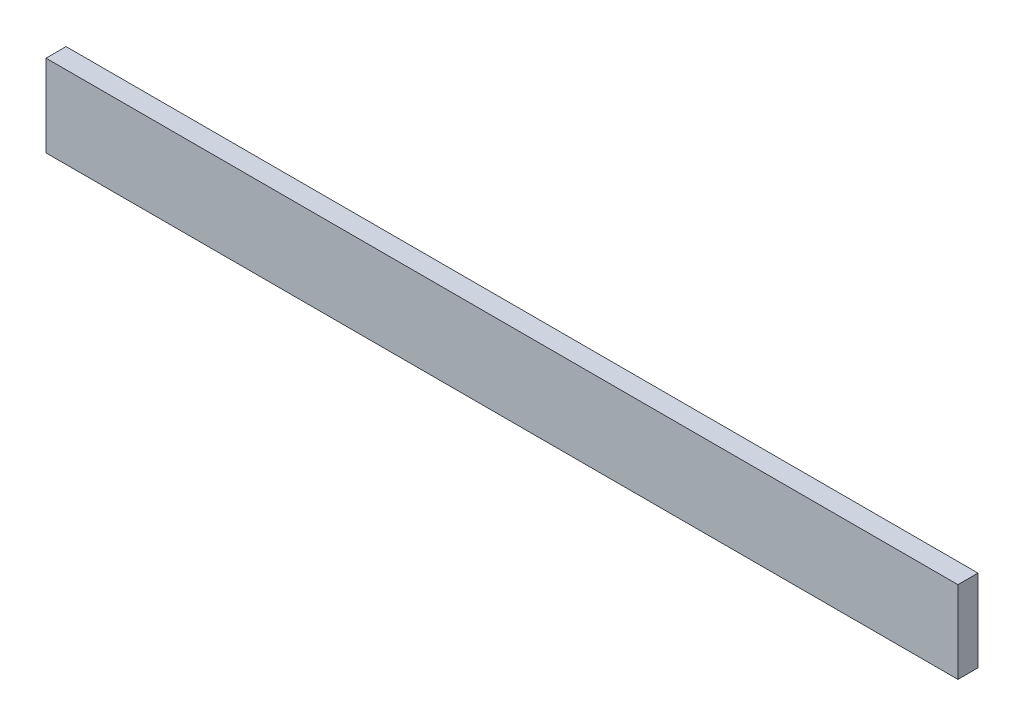
ISO-10303-21;
HEADER;
FILE_DESCRIPTION(('STEP AP214'),'2;1');
FILE_NAME('part.step','',(''),(''),'','','');
FILE_SCHEMA(('AUTOMOTIVE_DESIGN { 1 0 10303 214 1 1 1 1 }'));
ENDSEC;
DATA;
#1=APPLICATION_CONTEXT('core data for automotive mechanical design processes');
#2=APPLICATION_PROTOCOL_DEFINITION('international standard','automotive_design',2000,#1);
#3=PRODUCT_CONTEXT('',#1,'mechanical');
#4=PRODUCT('Part','Part','',(#3));
#5=PRODUCT_RELATED_PRODUCT_CATEGORY('part','',(#4));
#6=PRODUCT_DEFINITION_FORMATION('','',#4);
#7=PRODUCT_DEFINITION_CONTEXT('part definition',#1,'design');
#8=PRODUCT_DEFINITION('design','',#6,#7);
#9=PRODUCT_DEFINITION_SHAPE('','',#8);
#10=(LENGTH_UNIT() NAMED_UNIT(*) SI_UNIT(.MILLI.,.METRE.));
#11=(NAMED_UNIT(*) PLANE_ANGLE_UNIT() SI_UNIT($,.RADIAN.));
#12=(NAMED_UNIT(*) SI_UNIT($,.STERADIAN.) SOLID_ANGLE_UNIT());
#13=UNCERTAINTY_MEASURE_WITH_UNIT(LENGTH_MEASURE(1.E-05),#10,'distance_accuracy_value','');
#14=(GEOMETRIC_REPRESENTATION_CONTEXT(3) GLOBAL_UNCERTAINTY_ASSIGNED_CONTEXT((#13)) GLOBAL_UNIT_ASSIGNED_CONTEXT((#10,
#11,#12)) REPRESENTATION_CONTEXT('',''));
#15=CARTESIAN_POINT('',(0.,0.,0.));
#16=DIRECTION('',(0.,0.,1.));
#17=DIRECTION('',(1.,0.,0.));
#18=AXIS2_PLACEMENT_3D('',#15,#16,#17);
#19=CARTESIAN_POINT('',(0.,0.,22.));
#20=DIRECTION('',(1.,0.,0.));
#21=DIRECTION('',(0.,0.,-1.));
#22=AXIS2_PLACEMENT_3D('',#19,#20,#21);
#23=PLANE('',#22);
#24=DIRECTION('',(0.,-1.,0.));
#25=VECTOR('',#24,1.);
#26=CARTESIAN_POINT('',(0.,0.,0.));
#27=LINE('',#26,#25);
#28=CARTESIAN_POINT('',(0.,90.,0.));
#29=VERTEX_POINT('',#28);
#30=CARTESIAN_POINT('',(0.,0.,0.));
#31=VERTEX_POINT('',#30);
#32=EDGE_CURVE('E94',#29,#31,#27,.T.);
#33=ORIENTED_EDGE('',*,*,#32,.T.);
#34=DIRECTION('',(0.,0.,-1.));
#35=VECTOR('',#34,1.);
#36=CARTESIAN_POINT('',(0.,0.,22.));
#37=LINE('',#36,#35);
#38=CARTESIAN_POINT('',(0.,0.,22.));
#39=VERTEX_POINT('',#38);
#40=EDGE_CURVE('E11',#39,#31,#37,.T.);
#41=ORIENTED_EDGE('',*,*,#40,.F.);
#42=DIRECTION('',(0.,-1.,0.));
#43=VECTOR('',#42,1.);
#44=CARTESIAN_POINT('',(0.,0.,22.));
#45=LINE('',#44,#43);
#46=CARTESIAN_POINT('',(0.,90.,22.));
#47=VERTEX_POINT('',#46);
#48=EDGE_CURVE('E82',#47,#39,#45,.T.);
#49=ORIENTED_EDGE('',*,*,#48,.F.);
#50=DIRECTION('',(0.,0.,-1.));
#51=VECTOR('',#50,1.);
#52=CARTESIAN_POINT('',(0.,90.,22.));
#53=LINE('',#52,#51);
#54=EDGE_CURVE('E90',#47,#29,#53,.T.);
#55=ORIENTED_EDGE('',*,*,#54,.T.);
#56=EDGE_LOOP('',(#33,#41,#49,#55));
#57=FACE_BOUND('',#56,.T.);
#58=ADVANCED_FACE('F31',(#57),#23,.F.);
#59=CARTESIAN_POINT('',(0.,0.,22.));
#60=DIRECTION('',(0.,1.,0.));
#61=DIRECTION('',(0.,0.,1.));
#62=AXIS2_PLACEMENT_3D('',#59,#60,#61);
#63=PLANE('',#62);
#64=DIRECTION('',(1.,0.,0.));
#65=VECTOR('',#64,1.);
#66=CARTESIAN_POINT('',(0.,0.,0.));
#67=LINE('',#66,#65);
#68=CARTESIAN_POINT('',(1000.,0.,0.));
#69=VERTEX_POINT('',#68);
#70=EDGE_CURVE('E86',#31,#69,#67,.T.);
#71=ORIENTED_EDGE('',*,*,#70,.T.);
#72=DIRECTION('',(0.,0.,-1.));
#73=VECTOR('',#72,1.);
#74=CARTESIAN_POINT('',(1000.,0.,22.));
#75=LINE('',#74,#73);
#76=CARTESIAN_POINT('',(1000.,0.,22.));
#77=VERTEX_POINT('',#76);
#78=EDGE_CURVE('E39',#77,#69,#75,.T.);
#79=ORIENTED_EDGE('',*,*,#78,.F.);
#80=DIRECTION('',(1.,0.,0.));
#81=VECTOR('',#80,1.);
#82=CARTESIAN_POINT('',(0.,0.,22.));
#83=LINE('',#82,#81);
#84=EDGE_CURVE('E77',#39,#77,#83,.T.);
#85=ORIENTED_EDGE('',*,*,#84,.F.);
#86=ORIENTED_EDGE('',*,*,#40,.T.);
#87=EDGE_LOOP('',(#71,#79,#85,#86));
#88=FACE_BOUND('',#87,.T.);
#89=ADVANCED_FACE('F85',(#88),#63,.F.);
#90=CARTESIAN_POINT('',(1000.,0.,22.));
#91=DIRECTION('',(-1.,0.,0.));
#92=DIRECTION('',(0.,0.,1.));
#93=AXIS2_PLACEMENT_3D('',#90,#91,#92);
#94=PLANE('',#93);
#95=DIRECTION('',(0.,1.,0.));
#96=VECTOR('',#95,1.);
#97=CARTESIAN_POINT('',(1000.,0.,0.));
#98=LINE('',#97,#96);
#99=CARTESIAN_POINT('',(1000.,90.,0.));
#100=VERTEX_POINT('',#99);
#101=EDGE_CURVE('E64',#69,#100,#98,.T.);
#102=ORIENTED_EDGE('',*,*,#101,.T.);
#103=DIRECTION('',(0.,0.,-1.));
#104=VECTOR('',#103,1.);
#105=CARTESIAN_POINT('',(1000.,90.,22.));
#106=LINE('',#105,#104);
#107=CARTESIAN_POINT('',(1000.,90.,22.));
#108=VERTEX_POINT('',#107);
#109=EDGE_CURVE('E87',#108,#100,#106,.T.);
#110=ORIENTED_EDGE('',*,*,#109,.F.);
#111=DIRECTION('',(0.,1.,0.));
#112=VECTOR('',#111,1.);
#113=CARTESIAN_POINT('',(1000.,0.,22.));
#114=LINE('',#113,#112);
#115=EDGE_CURVE('E80',#77,#108,#114,.T.);
#116=ORIENTED_EDGE('',*,*,#115,.F.);
#117=ORIENTED_EDGE('',*,*,#78,.T.);
#118=EDGE_LOOP('',(#102,#110,#116,#117));
#119=FACE_BOUND('',#118,.T.);
#120=ADVANCED_FACE('F88',(#119),#94,.F.);
#121=CARTESIAN_POINT('',(0.,90.,22.));
#122=DIRECTION('',(0.,-1.,0.));
#123=DIRECTION('',(0.,0.,-1.));
#124=AXIS2_PLACEMENT_3D('',#121,#122,#123);
#125=PLANE('',#124);
#126=DIRECTION('',(-1.,0.,0.));
#127=VECTOR('',#126,1.);
#128=CARTESIAN_POINT('',(0.,90.,0.));
#129=LINE('',#128,#127);
#130=EDGE_CURVE('E70',#100,#29,#129,.T.);
#131=ORIENTED_EDGE('',*,*,#130,.T.);
#132=ORIENTED_EDGE('',*,*,#54,.F.);
#133=DIRECTION('',(-1.,0.,0.));
#134=VECTOR('',#133,1.);
#135=CARTESIAN_POINT('',(0.,90.,22.));
#136=LINE('',#135,#134);
#137=EDGE_CURVE('E47',#108,#47,#136,.T.);
#138=ORIENTED_EDGE('',*,*,#137,.F.);
#139=ORIENTED_EDGE('',*,*,#109,.T.);
#140=EDGE_LOOP('',(#131,#132,#138,#139));
#141=FACE_BOUND('',#140,.T.);
#142=ADVANCED_FACE('F101',(#141),#125,.F.);
#143=CARTESIAN_POINT('',(0.,90.,22.));
#144=DIRECTION('',(0.,0.,-1.));
#145=DIRECTION('',(-1.,0.,0.));
#146=AXIS2_PLACEMENT_3D('',#143,#144,#145);
#147=PLANE('',#146);
#148=ORIENTED_EDGE('',*,*,#48,.T.);
#149=ORIENTED_EDGE('',*,*,#84,.T.);
#150=ORIENTED_EDGE('',*,*,#115,.T.);
#151=ORIENTED_EDGE('',*,*,#137,.T.);
#152=EDGE_LOOP('',(#148,#149,#150,#151));
#153=FACE_BOUND('',#152,.T.);
#154=ADVANCED_FACE('F78',(#153),#147,.F.);
#155=CARTESIAN_POINT('',(0.,90.,0.));
#156=DIRECTION('',(0.,0.,-1.));
#157=DIRECTION('',(-1.,0.,0.));
#158=AXIS2_PLACEMENT_3D('',#155,#156,#157);
#159=PLANE('',#158);
#160=ORIENTED_EDGE('',*,*,#32,.F.);
#161=ORIENTED_EDGE('',*,*,#130,.F.);
#162=ORIENTED_EDGE('',*,*,#101,.F.);
#163=ORIENTED_EDGE('',*,*,#70,.F.);
#164=EDGE_LOOP('',(#160,#161,#162,#163));
#165=FACE_BOUND('',#164,.T.);
#166=ADVANCED_FACE('F104',(#165),#159,.T.);
#167=CLOSED_SHELL('',(#58,#89,#120,#142,#154,#166));
#168=MANIFOLD_SOLID_BREP('B2',#167);
#169=ADVANCED_BREP_SHAPE_REPRESENTATION('',(#18,#168),#14);
#170=SHAPE_DEFINITION_REPRESENTATION(#9,#169);
ENDSEC;
END-ISO-10303-21;
